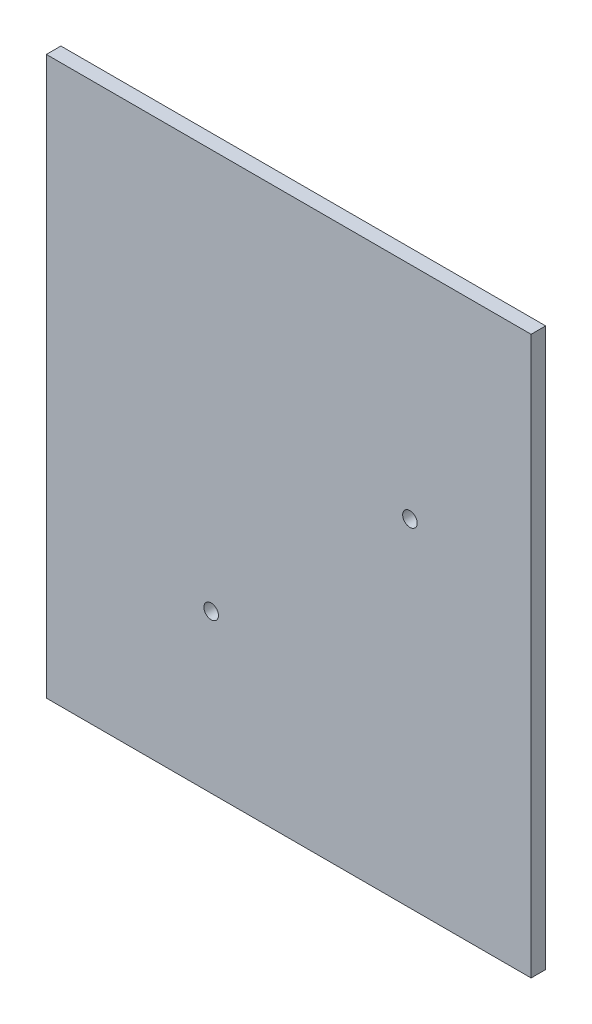
ISO-10303-21;
HEADER;
FILE_DESCRIPTION(('STEP AP214'),'2;1');
FILE_NAME('part.step','',(''),(''),'','','');
FILE_SCHEMA(('AUTOMOTIVE_DESIGN { 1 0 10303 214 1 1 1 1 }'));
ENDSEC;
DATA;
#1=APPLICATION_CONTEXT('core data for automotive mechanical design processes');
#2=APPLICATION_PROTOCOL_DEFINITION('international standard','automotive_design',2000,#1);
#3=PRODUCT_CONTEXT('',#1,'mechanical');
#4=PRODUCT('Part','Part','',(#3));
#5=PRODUCT_RELATED_PRODUCT_CATEGORY('part','',(#4));
#6=PRODUCT_DEFINITION_FORMATION('','',#4);
#7=PRODUCT_DEFINITION_CONTEXT('part definition',#1,'design');
#8=PRODUCT_DEFINITION('design','',#6,#7);
#9=PRODUCT_DEFINITION_SHAPE('','',#8);
#10=(LENGTH_UNIT() NAMED_UNIT(*) SI_UNIT(.MILLI.,.METRE.));
#11=(NAMED_UNIT(*) PLANE_ANGLE_UNIT() SI_UNIT($,.RADIAN.));
#12=(NAMED_UNIT(*) SI_UNIT($,.STERADIAN.) SOLID_ANGLE_UNIT());
#13=UNCERTAINTY_MEASURE_WITH_UNIT(LENGTH_MEASURE(1.E-05),#10,'distance_accuracy_value','');
#14=(GEOMETRIC_REPRESENTATION_CONTEXT(3) GLOBAL_UNCERTAINTY_ASSIGNED_CONTEXT((#13)) GLOBAL_UNIT_ASSIGNED_CONTEXT((#10,
#11,#12)) REPRESENTATION_CONTEXT('',''));
#15=CARTESIAN_POINT('',(0.,0.,0.));
#16=DIRECTION('',(0.,0.,1.));
#17=DIRECTION('',(1.,0.,0.));
#18=AXIS2_PLACEMENT_3D('',#15,#16,#17);
#19=CARTESIAN_POINT('',(50.,57.5,3.));
#20=DIRECTION('',(-1.,0.,0.));
#21=DIRECTION('',(0.,-1.,0.));
#22=AXIS2_PLACEMENT_3D('',#19,#20,#21);
#23=PLANE('',#22);
#24=DIRECTION('',(0.,1.,0.));
#25=VECTOR('',#24,1.);
#26=CARTESIAN_POINT('',(50.,57.5,0.));
#27=LINE('',#26,#25);
#28=CARTESIAN_POINT('',(50.,-57.5,0.));
#29=VERTEX_POINT('',#28);
#30=CARTESIAN_POINT('',(50.,57.5,0.));
#31=VERTEX_POINT('',#30);
#32=EDGE_CURVE('E95',#29,#31,#27,.T.);
#33=ORIENTED_EDGE('',*,*,#32,.T.);
#34=DIRECTION('',(0.,0.,-1.));
#35=VECTOR('',#34,1.);
#36=CARTESIAN_POINT('',(50.,57.5,3.));
#37=LINE('',#36,#35);
#38=CARTESIAN_POINT('',(50.,57.5,3.));
#39=VERTEX_POINT('',#38);
#40=EDGE_CURVE('E11',#39,#31,#37,.T.);
#41=ORIENTED_EDGE('',*,*,#40,.F.);
#42=DIRECTION('',(0.,1.,0.));
#43=VECTOR('',#42,1.);
#44=CARTESIAN_POINT('',(50.,57.5,3.));
#45=LINE('',#44,#43);
#46=CARTESIAN_POINT('',(50.,-57.5,3.));
#47=VERTEX_POINT('',#46);
#48=EDGE_CURVE('E83',#47,#39,#45,.T.);
#49=ORIENTED_EDGE('',*,*,#48,.F.);
#50=DIRECTION('',(0.,0.,-1.));
#51=VECTOR('',#50,1.);
#52=CARTESIAN_POINT('',(50.,-57.5,3.));
#53=LINE('',#52,#51);
#54=EDGE_CURVE('E91',#47,#29,#53,.T.);
#55=ORIENTED_EDGE('',*,*,#54,.T.);
#56=EDGE_LOOP('',(#33,#41,#49,#55));
#57=FACE_BOUND('',#56,.T.);
#58=ADVANCED_FACE('F32',(#57),#23,.F.);
#59=CARTESIAN_POINT('',(-50.,57.5,3.));
#60=DIRECTION('',(0.,-1.,0.));
#61=DIRECTION('',(0.,0.,-1.));
#62=AXIS2_PLACEMENT_3D('',#59,#60,#61);
#63=PLANE('',#62);
#64=DIRECTION('',(-1.,0.,0.));
#65=VECTOR('',#64,1.);
#66=CARTESIAN_POINT('',(-50.,57.5,0.));
#67=LINE('',#66,#65);
#68=CARTESIAN_POINT('',(-50.,57.5,0.));
#69=VERTEX_POINT('',#68);
#70=EDGE_CURVE('E87',#31,#69,#67,.T.);
#71=ORIENTED_EDGE('',*,*,#70,.T.);
#72=DIRECTION('',(0.,0.,-1.));
#73=VECTOR('',#72,1.);
#74=CARTESIAN_POINT('',(-50.,57.5,3.));
#75=LINE('',#74,#73);
#76=CARTESIAN_POINT('',(-50.,57.5,3.));
#77=VERTEX_POINT('',#76);
#78=EDGE_CURVE('E40',#77,#69,#75,.T.);
#79=ORIENTED_EDGE('',*,*,#78,.F.);
#80=DIRECTION('',(-1.,0.,0.));
#81=VECTOR('',#80,1.);
#82=CARTESIAN_POINT('',(-50.,57.5,3.));
#83=LINE('',#82,#81);
#84=EDGE_CURVE('E78',#39,#77,#83,.T.);
#85=ORIENTED_EDGE('',*,*,#84,.F.);
#86=ORIENTED_EDGE('',*,*,#40,.T.);
#87=EDGE_LOOP('',(#71,#79,#85,#86));
#88=FACE_BOUND('',#87,.T.);
#89=ADVANCED_FACE('F86',(#88),#63,.F.);
#90=CARTESIAN_POINT('',(-50.,57.5,3.));
#91=DIRECTION('',(1.,0.,0.));
#92=DIRECTION('',(0.,1.,0.));
#93=AXIS2_PLACEMENT_3D('',#90,#91,#92);
#94=PLANE('',#93);
#95=DIRECTION('',(0.,-1.,0.));
#96=VECTOR('',#95,1.);
#97=CARTESIAN_POINT('',(-50.,57.5,0.));
#98=LINE('',#97,#96);
#99=CARTESIAN_POINT('',(-50.,-57.5,0.));
#100=VERTEX_POINT('',#99);
#101=EDGE_CURVE('E65',#69,#100,#98,.T.);
#102=ORIENTED_EDGE('',*,*,#101,.T.);
#103=DIRECTION('',(0.,0.,-1.));
#104=VECTOR('',#103,1.);
#105=CARTESIAN_POINT('',(-50.,-57.5,3.));
#106=LINE('',#105,#104);
#107=CARTESIAN_POINT('',(-50.,-57.5,3.));
#108=VERTEX_POINT('',#107);
#109=EDGE_CURVE('E88',#108,#100,#106,.T.);
#110=ORIENTED_EDGE('',*,*,#109,.F.);
#111=DIRECTION('',(0.,-1.,0.));
#112=VECTOR('',#111,1.);
#113=CARTESIAN_POINT('',(-50.,57.5,3.));
#114=LINE('',#113,#112);
#115=EDGE_CURVE('E81',#77,#108,#114,.T.);
#116=ORIENTED_EDGE('',*,*,#115,.F.);
#117=ORIENTED_EDGE('',*,*,#78,.T.);
#118=EDGE_LOOP('',(#102,#110,#116,#117));
#119=FACE_BOUND('',#118,.T.);
#120=ADVANCED_FACE('F89',(#119),#94,.F.);
#121=CARTESIAN_POINT('',(-50.,-57.5,3.));
#122=DIRECTION('',(0.,1.,0.));
#123=DIRECTION('',(0.,0.,1.));
#124=AXIS2_PLACEMENT_3D('',#121,#122,#123);
#125=PLANE('',#124);
#126=DIRECTION('',(1.,0.,0.));
#127=VECTOR('',#126,1.);
#128=CARTESIAN_POINT('',(-50.,-57.5,0.));
#129=LINE('',#128,#127);
#130=EDGE_CURVE('E71',#100,#29,#129,.T.);
#131=ORIENTED_EDGE('',*,*,#130,.T.);
#132=ORIENTED_EDGE('',*,*,#54,.F.);
#133=DIRECTION('',(1.,0.,0.));
#134=VECTOR('',#133,1.);
#135=CARTESIAN_POINT('',(-50.,-57.5,3.));
#136=LINE('',#135,#134);
#137=EDGE_CURVE('E48',#108,#47,#136,.T.);
#138=ORIENTED_EDGE('',*,*,#137,.F.);
#139=ORIENTED_EDGE('',*,*,#109,.T.);
#140=EDGE_LOOP('',(#131,#132,#138,#139));
#141=FACE_BOUND('',#140,.T.);
#142=ADVANCED_FACE('F103',(#141),#125,.F.);
#143=CARTESIAN_POINT('',(0.,0.,3.));
#144=DIRECTION('',(0.,0.,1.));
#145=DIRECTION('',(1.,0.,0.));
#146=AXIS2_PLACEMENT_3D('',#143,#144,#145);
#147=PLANE('',#146);
#148=CARTESIAN_POINT('',(25.,12.,3.));
#149=DIRECTION('',(0.,0.,1.));
#150=DIRECTION('',(1.,0.,0.));
#151=AXIS2_PLACEMENT_3D('',#148,#149,#150);
#152=CIRCLE('',#151,1.5);
#153=CARTESIAN_POINT('',(26.5,12.,3.));
#154=VERTEX_POINT('',#153);
#155=EDGE_CURVE('E115',#154,#154,#152,.T.);
#156=ORIENTED_EDGE('',*,*,#155,.F.);
#157=EDGE_LOOP('',(#156));
#158=FACE_BOUND('',#157,.T.);
#159=CARTESIAN_POINT('',(-16.,-25.,3.));
#160=DIRECTION('',(0.,0.,1.));
#161=DIRECTION('',(1.,0.,0.));
#162=AXIS2_PLACEMENT_3D('',#159,#160,#161);
#163=CIRCLE('',#162,1.5);
#164=CARTESIAN_POINT('',(-14.5,-25.,3.));
#165=VERTEX_POINT('',#164);
#166=EDGE_CURVE('E109',#165,#165,#163,.T.);
#167=ORIENTED_EDGE('',*,*,#166,.F.);
#168=EDGE_LOOP('',(#167));
#169=FACE_BOUND('',#168,.T.);
#170=ORIENTED_EDGE('',*,*,#48,.T.);
#171=ORIENTED_EDGE('',*,*,#84,.T.);
#172=ORIENTED_EDGE('',*,*,#115,.T.);
#173=ORIENTED_EDGE('',*,*,#137,.T.);
#174=EDGE_LOOP('',(#170,#171,#172,#173));
#175=FACE_BOUND('',#174,.T.);
#176=ADVANCED_FACE('F79',(#158,#169,#175),#147,.T.);
#177=CARTESIAN_POINT('',(0.,0.,0.));
#178=DIRECTION('',(0.,0.,1.));
#179=DIRECTION('',(1.,0.,0.));
#180=AXIS2_PLACEMENT_3D('',#177,#178,#179);
#181=PLANE('',#180);
#182=CARTESIAN_POINT('',(25.,12.,0.));
#183=DIRECTION('',(0.,0.,1.));
#184=DIRECTION('',(1.,0.,0.));
#185=AXIS2_PLACEMENT_3D('',#182,#183,#184);
#186=CIRCLE('',#185,1.5);
#187=CARTESIAN_POINT('',(26.5,12.,0.));
#188=VERTEX_POINT('',#187);
#189=EDGE_CURVE('E98',#188,#188,#186,.T.);
#190=ORIENTED_EDGE('',*,*,#189,.T.);
#191=EDGE_LOOP('',(#190));
#192=FACE_BOUND('',#191,.T.);
#193=CARTESIAN_POINT('',(-16.,-25.,0.));
#194=DIRECTION('',(0.,0.,1.));
#195=DIRECTION('',(1.,0.,0.));
#196=AXIS2_PLACEMENT_3D('',#193,#194,#195);
#197=CIRCLE('',#196,1.5);
#198=CARTESIAN_POINT('',(-14.5,-25.,0.));
#199=VERTEX_POINT('',#198);
#200=EDGE_CURVE('E112',#199,#199,#197,.T.);
#201=ORIENTED_EDGE('',*,*,#200,.T.);
#202=EDGE_LOOP('',(#201));
#203=FACE_BOUND('',#202,.T.);
#204=ORIENTED_EDGE('',*,*,#32,.F.);
#205=ORIENTED_EDGE('',*,*,#130,.F.);
#206=ORIENTED_EDGE('',*,*,#101,.F.);
#207=ORIENTED_EDGE('',*,*,#70,.F.);
#208=EDGE_LOOP('',(#204,#205,#206,#207));
#209=FACE_BOUND('',#208,.T.);
#210=ADVANCED_FACE('F106',(#192,#203,#209),#181,.F.);
#211=CARTESIAN_POINT('',(-16.,-25.,0.));
#212=DIRECTION('',(0.,0.,1.));
#213=DIRECTION('',(1.,0.,0.));
#214=AXIS2_PLACEMENT_3D('',#211,#212,#213);
#215=CYLINDRICAL_SURFACE('',#214,1.5);
#216=ORIENTED_EDGE('',*,*,#200,.F.);
#217=EDGE_LOOP('',(#216));
#218=FACE_BOUND('',#217,.T.);
#219=ORIENTED_EDGE('',*,*,#166,.T.);
#220=EDGE_LOOP('',(#219));
#221=FACE_BOUND('',#220,.T.);
#222=ADVANCED_FACE('F126',(#218,#221),#215,.F.);
#223=CARTESIAN_POINT('',(25.,12.,0.));
#224=DIRECTION('',(0.,0.,1.));
#225=DIRECTION('',(1.,0.,0.));
#226=AXIS2_PLACEMENT_3D('',#223,#224,#225);
#227=CYLINDRICAL_SURFACE('',#226,1.5);
#228=ORIENTED_EDGE('',*,*,#189,.F.);
#229=EDGE_LOOP('',(#228));
#230=FACE_BOUND('',#229,.T.);
#231=ORIENTED_EDGE('',*,*,#155,.T.);
#232=EDGE_LOOP('',(#231));
#233=FACE_BOUND('',#232,.T.);
#234=ADVANCED_FACE('F123',(#230,#233),#227,.F.);
#235=CLOSED_SHELL('',(#58,#89,#120,#142,#176,#210,#222,#234));
#236=MANIFOLD_SOLID_BREP('B2',#235);
#237=ADVANCED_BREP_SHAPE_REPRESENTATION('',(#18,#236),#14);
#238=SHAPE_DEFINITION_REPRESENTATION(#9,#237);
ENDSEC;
END-ISO-10303-21;
